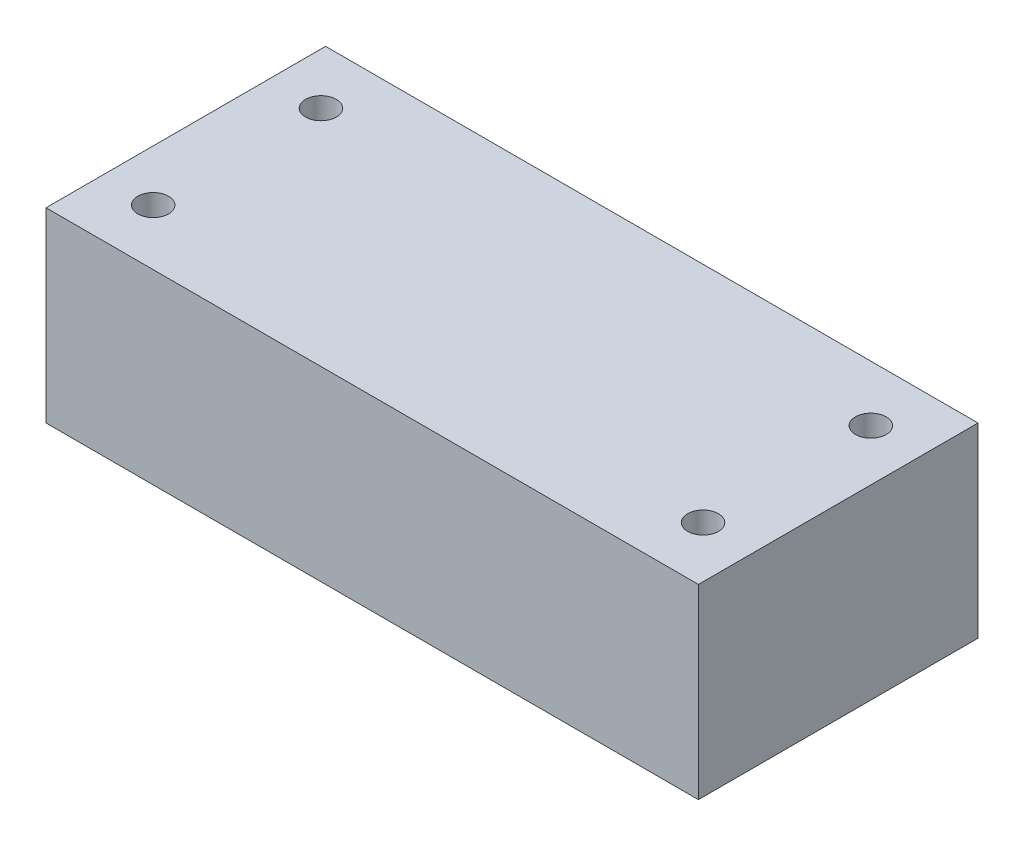
ISO-10303-21;
HEADER;
FILE_DESCRIPTION(('STEP AP214'),'2;1');
FILE_NAME('part.step','',(''),(''),'','','');
FILE_SCHEMA(('AUTOMOTIVE_DESIGN { 1 0 10303 214 1 1 1 1 }'));
ENDSEC;
DATA;
#1=APPLICATION_CONTEXT('core data for automotive mechanical design processes');
#2=APPLICATION_PROTOCOL_DEFINITION('international standard','automotive_design',2000,#1);
#3=PRODUCT_CONTEXT('',#1,'mechanical');
#4=PRODUCT('Part','Part','',(#3));
#5=PRODUCT_RELATED_PRODUCT_CATEGORY('part','',(#4));
#6=PRODUCT_DEFINITION_FORMATION('','',#4);
#7=PRODUCT_DEFINITION_CONTEXT('part definition',#1,'design');
#8=PRODUCT_DEFINITION('design','',#6,#7);
#9=PRODUCT_DEFINITION_SHAPE('','',#8);
#10=(LENGTH_UNIT() NAMED_UNIT(*) SI_UNIT(.MILLI.,.METRE.));
#11=(NAMED_UNIT(*) PLANE_ANGLE_UNIT() SI_UNIT($,.RADIAN.));
#12=(NAMED_UNIT(*) SI_UNIT($,.STERADIAN.) SOLID_ANGLE_UNIT());
#13=UNCERTAINTY_MEASURE_WITH_UNIT(LENGTH_MEASURE(1.E-05),#10,'distance_accuracy_value','');
#14=(GEOMETRIC_REPRESENTATION_CONTEXT(3) GLOBAL_UNCERTAINTY_ASSIGNED_CONTEXT((#13)) GLOBAL_UNIT_ASSIGNED_CONTEXT((#10,
#11,#12)) REPRESENTATION_CONTEXT('',''));
#15=CARTESIAN_POINT('',(0.,0.,0.));
#16=DIRECTION('',(0.,0.,1.));
#17=DIRECTION('',(1.,0.,0.));
#18=AXIS2_PLACEMENT_3D('',#15,#16,#17);
#19=CARTESIAN_POINT('',(35.,20.,15.));
#20=DIRECTION('',(-1.,0.,0.));
#21=DIRECTION('',(0.,0.,1.));
#22=AXIS2_PLACEMENT_3D('',#19,#20,#21);
#23=PLANE('',#22);
#24=DIRECTION('',(0.,0.,-1.));
#25=VECTOR('',#24,1.);
#26=CARTESIAN_POINT('',(35.,0.,15.));
#27=LINE('',#26,#25);
#28=CARTESIAN_POINT('',(35.,0.,15.));
#29=VERTEX_POINT('',#28);
#30=CARTESIAN_POINT('',(35.,0.,-15.));
#31=VERTEX_POINT('',#30);
#32=EDGE_CURVE('E98',#29,#31,#27,.T.);
#33=ORIENTED_EDGE('',*,*,#32,.T.);
#34=DIRECTION('',(0.,-1.,0.));
#35=VECTOR('',#34,1.);
#36=CARTESIAN_POINT('',(35.,20.,-15.));
#37=LINE('',#36,#35);
#38=CARTESIAN_POINT('',(35.,20.,-15.));
#39=VERTEX_POINT('',#38);
#40=EDGE_CURVE('E11',#39,#31,#37,.T.);
#41=ORIENTED_EDGE('',*,*,#40,.F.);
#42=DIRECTION('',(0.,0.,-1.));
#43=VECTOR('',#42,1.);
#44=CARTESIAN_POINT('',(35.,20.,15.));
#45=LINE('',#44,#43);
#46=CARTESIAN_POINT('',(35.,20.,15.));
#47=VERTEX_POINT('',#46);
#48=EDGE_CURVE('E85',#47,#39,#45,.T.);
#49=ORIENTED_EDGE('',*,*,#48,.F.);
#50=DIRECTION('',(0.,-1.,0.));
#51=VECTOR('',#50,1.);
#52=CARTESIAN_POINT('',(35.,20.,15.));
#53=LINE('',#52,#51);
#54=EDGE_CURVE('E94',#47,#29,#53,.T.);
#55=ORIENTED_EDGE('',*,*,#54,.T.);
#56=EDGE_LOOP('',(#33,#41,#49,#55));
#57=FACE_BOUND('',#56,.T.);
#58=ADVANCED_FACE('F32',(#57),#23,.F.);
#59=CARTESIAN_POINT('',(-35.,20.,-15.));
#60=DIRECTION('',(0.,0.,1.));
#61=DIRECTION('',(1.,0.,0.));
#62=AXIS2_PLACEMENT_3D('',#59,#60,#61);
#63=PLANE('',#62);
#64=DIRECTION('',(-1.,0.,0.));
#65=VECTOR('',#64,1.);
#66=CARTESIAN_POINT('',(-35.,0.,-15.));
#67=LINE('',#66,#65);
#68=CARTESIAN_POINT('',(-35.,0.,-15.));
#69=VERTEX_POINT('',#68);
#70=EDGE_CURVE('E89',#31,#69,#67,.T.);
#71=ORIENTED_EDGE('',*,*,#70,.T.);
#72=DIRECTION('',(0.,-1.,0.));
#73=VECTOR('',#72,1.);
#74=CARTESIAN_POINT('',(-35.,20.,-15.));
#75=LINE('',#74,#73);
#76=CARTESIAN_POINT('',(-35.,20.,-15.));
#77=VERTEX_POINT('',#76);
#78=EDGE_CURVE('E41',#77,#69,#75,.T.);
#79=ORIENTED_EDGE('',*,*,#78,.F.);
#80=DIRECTION('',(-1.,0.,0.));
#81=VECTOR('',#80,1.);
#82=CARTESIAN_POINT('',(-35.,20.,-15.));
#83=LINE('',#82,#81);
#84=EDGE_CURVE('E80',#39,#77,#83,.T.);
#85=ORIENTED_EDGE('',*,*,#84,.F.);
#86=ORIENTED_EDGE('',*,*,#40,.T.);
#87=EDGE_LOOP('',(#71,#79,#85,#86));
#88=FACE_BOUND('',#87,.T.);
#89=ADVANCED_FACE('F88',(#88),#63,.F.);
#90=CARTESIAN_POINT('',(-35.,20.,15.));
#91=DIRECTION('',(1.,0.,0.));
#92=DIRECTION('',(0.,0.,-1.));
#93=AXIS2_PLACEMENT_3D('',#90,#91,#92);
#94=PLANE('',#93);
#95=DIRECTION('',(0.,0.,1.));
#96=VECTOR('',#95,1.);
#97=CARTESIAN_POINT('',(-35.,0.,15.));
#98=LINE('',#97,#96);
#99=CARTESIAN_POINT('',(-35.,0.,15.));
#100=VERTEX_POINT('',#99);
#101=EDGE_CURVE('E67',#69,#100,#98,.T.);
#102=ORIENTED_EDGE('',*,*,#101,.T.);
#103=DIRECTION('',(0.,-1.,0.));
#104=VECTOR('',#103,1.);
#105=CARTESIAN_POINT('',(-35.,20.,15.));
#106=LINE('',#105,#104);
#107=CARTESIAN_POINT('',(-35.,20.,15.));
#108=VERTEX_POINT('',#107);
#109=EDGE_CURVE('E90',#108,#100,#106,.T.);
#110=ORIENTED_EDGE('',*,*,#109,.F.);
#111=DIRECTION('',(0.,0.,1.));
#112=VECTOR('',#111,1.);
#113=CARTESIAN_POINT('',(-35.,20.,15.));
#114=LINE('',#113,#112);
#115=EDGE_CURVE('E83',#77,#108,#114,.T.);
#116=ORIENTED_EDGE('',*,*,#115,.F.);
#117=ORIENTED_EDGE('',*,*,#78,.T.);
#118=EDGE_LOOP('',(#102,#110,#116,#117));
#119=FACE_BOUND('',#118,.T.);
#120=ADVANCED_FACE('F92',(#119),#94,.F.);
#121=CARTESIAN_POINT('',(-35.,20.,15.));
#122=DIRECTION('',(0.,0.,-1.));
#123=DIRECTION('',(-1.,0.,0.));
#124=AXIS2_PLACEMENT_3D('',#121,#122,#123);
#125=PLANE('',#124);
#126=DIRECTION('',(1.,0.,0.));
#127=VECTOR('',#126,1.);
#128=CARTESIAN_POINT('',(-35.,0.,15.));
#129=LINE('',#128,#127);
#130=EDGE_CURVE('E73',#100,#29,#129,.T.);
#131=ORIENTED_EDGE('',*,*,#130,.T.);
#132=ORIENTED_EDGE('',*,*,#54,.F.);
#133=DIRECTION('',(1.,0.,0.));
#134=VECTOR('',#133,1.);
#135=CARTESIAN_POINT('',(-35.,20.,15.));
#136=LINE('',#135,#134);
#137=EDGE_CURVE('E50',#108,#47,#136,.T.);
#138=ORIENTED_EDGE('',*,*,#137,.F.);
#139=ORIENTED_EDGE('',*,*,#109,.T.);
#140=EDGE_LOOP('',(#131,#132,#138,#139));
#141=FACE_BOUND('',#140,.T.);
#142=ADVANCED_FACE('F139',(#141),#125,.F.);
#143=CARTESIAN_POINT('',(0.,20.,0.));
#144=DIRECTION('',(0.,-1.,0.));
#145=DIRECTION('',(0.,0.,-1.));
#146=AXIS2_PLACEMENT_3D('',#143,#144,#145);
#147=PLANE('',#146);
#148=CARTESIAN_POINT('',(29.5,20.,-9.));
#149=DIRECTION('',(0.,1.,0.));
#150=DIRECTION('',(0.,0.,1.));
#151=AXIS2_PLACEMENT_3D('',#148,#149,#150);
#152=CIRCLE('',#151,1.65);
#153=CARTESIAN_POINT('',(29.5,20.,-7.35));
#154=VERTEX_POINT('',#153);
#155=EDGE_CURVE('E113',#154,#154,#152,.T.);
#156=ORIENTED_EDGE('',*,*,#155,.F.);
#157=EDGE_LOOP('',(#156));
#158=FACE_BOUND('',#157,.T.);
#159=CARTESIAN_POINT('',(29.5,20.,9.));
#160=DIRECTION('',(0.,1.,0.));
#161=DIRECTION('',(0.,0.,1.));
#162=AXIS2_PLACEMENT_3D('',#159,#160,#161);
#163=CIRCLE('',#162,1.65);
#164=CARTESIAN_POINT('',(29.5,20.,10.65));
#165=VERTEX_POINT('',#164);
#166=EDGE_CURVE('E128',#165,#165,#163,.T.);
#167=ORIENTED_EDGE('',*,*,#166,.F.);
#168=EDGE_LOOP('',(#167));
#169=FACE_BOUND('',#168,.T.);
#170=CARTESIAN_POINT('',(-29.5,20.,9.));
#171=DIRECTION('',(0.,1.,0.));
#172=DIRECTION('',(0.,0.,1.));
#173=AXIS2_PLACEMENT_3D('',#170,#171,#172);
#174=CIRCLE('',#173,1.65);
#175=CARTESIAN_POINT('',(-29.5,20.,10.65));
#176=VERTEX_POINT('',#175);
#177=EDGE_CURVE('E125',#176,#176,#174,.T.);
#178=ORIENTED_EDGE('',*,*,#177,.F.);
#179=EDGE_LOOP('',(#178));
#180=FACE_BOUND('',#179,.T.);
#181=CARTESIAN_POINT('',(-29.5,20.,-9.));
#182=DIRECTION('',(0.,1.,0.));
#183=DIRECTION('',(0.,0.,1.));
#184=AXIS2_PLACEMENT_3D('',#181,#182,#183);
#185=CIRCLE('',#184,1.65);
#186=CARTESIAN_POINT('',(-29.5,20.,-7.35));
#187=VERTEX_POINT('',#186);
#188=EDGE_CURVE('E109',#187,#187,#185,.T.);
#189=ORIENTED_EDGE('',*,*,#188,.F.);
#190=EDGE_LOOP('',(#189));
#191=FACE_BOUND('',#190,.T.);
#192=ORIENTED_EDGE('',*,*,#48,.T.);
#193=ORIENTED_EDGE('',*,*,#84,.T.);
#194=ORIENTED_EDGE('',*,*,#115,.T.);
#195=ORIENTED_EDGE('',*,*,#137,.T.);
#196=EDGE_LOOP('',(#192,#193,#194,#195));
#197=FACE_BOUND('',#196,.T.);
#198=ADVANCED_FACE('F81',(#158,#169,#180,#191,#197),#147,.F.);
#199=CARTESIAN_POINT('',(0.,0.,0.));
#200=DIRECTION('',(0.,-1.,0.));
#201=DIRECTION('',(0.,0.,-1.));
#202=AXIS2_PLACEMENT_3D('',#199,#200,#201);
#203=PLANE('',#202);
#204=CARTESIAN_POINT('',(29.5,0.,-9.));
#205=DIRECTION('',(0.,-1.,0.));
#206=DIRECTION('',(0.,0.,-1.));
#207=AXIS2_PLACEMENT_3D('',#204,#205,#206);
#208=CIRCLE('',#207,1.65);
#209=CARTESIAN_POINT('',(29.5,0.,-10.65));
#210=VERTEX_POINT('',#209);
#211=EDGE_CURVE('E35',#210,#210,#208,.T.);
#212=ORIENTED_EDGE('',*,*,#211,.F.);
#213=EDGE_LOOP('',(#212));
#214=FACE_BOUND('',#213,.T.);
#215=CARTESIAN_POINT('',(29.5,0.,9.));
#216=DIRECTION('',(0.,-1.,0.));
#217=DIRECTION('',(0.,0.,-1.));
#218=AXIS2_PLACEMENT_3D('',#215,#216,#217);
#219=CIRCLE('',#218,1.65);
#220=CARTESIAN_POINT('',(29.5,0.,7.35));
#221=VERTEX_POINT('',#220);
#222=EDGE_CURVE('E112',#221,#221,#219,.T.);
#223=ORIENTED_EDGE('',*,*,#222,.F.);
#224=EDGE_LOOP('',(#223));
#225=FACE_BOUND('',#224,.T.);
#226=CARTESIAN_POINT('',(-29.5,0.,9.));
#227=DIRECTION('',(0.,-1.,0.));
#228=DIRECTION('',(0.,0.,-1.));
#229=AXIS2_PLACEMENT_3D('',#226,#227,#228);
#230=CIRCLE('',#229,1.65);
#231=CARTESIAN_POINT('',(-29.5,0.,7.35));
#232=VERTEX_POINT('',#231);
#233=EDGE_CURVE('E110',#232,#232,#230,.T.);
#234=ORIENTED_EDGE('',*,*,#233,.F.);
#235=EDGE_LOOP('',(#234));
#236=FACE_BOUND('',#235,.T.);
#237=CARTESIAN_POINT('',(-29.5,0.,-9.));
#238=DIRECTION('',(0.,-1.,0.));
#239=DIRECTION('',(0.,0.,-1.));
#240=AXIS2_PLACEMENT_3D('',#237,#238,#239);
#241=CIRCLE('',#240,1.65);
#242=CARTESIAN_POINT('',(-29.5,0.,-10.65));
#243=VERTEX_POINT('',#242);
#244=EDGE_CURVE('E101',#243,#243,#241,.T.);
#245=ORIENTED_EDGE('',*,*,#244,.F.);
#246=EDGE_LOOP('',(#245));
#247=FACE_BOUND('',#246,.T.);
#248=ORIENTED_EDGE('',*,*,#32,.F.);
#249=ORIENTED_EDGE('',*,*,#130,.F.);
#250=ORIENTED_EDGE('',*,*,#101,.F.);
#251=ORIENTED_EDGE('',*,*,#70,.F.);
#252=EDGE_LOOP('',(#248,#249,#250,#251));
#253=FACE_BOUND('',#252,.T.);
#254=ADVANCED_FACE('F138',(#214,#225,#236,#247,#253),#203,.T.);
#255=CARTESIAN_POINT('',(-29.5,-10.,-9.));
#256=DIRECTION('',(0.,1.,0.));
#257=DIRECTION('',(0.,0.,1.));
#258=AXIS2_PLACEMENT_3D('',#255,#256,#257);
#259=CYLINDRICAL_SURFACE('',#258,1.65);
#260=ORIENTED_EDGE('',*,*,#244,.T.);
#261=EDGE_LOOP('',(#260));
#262=FACE_BOUND('',#261,.T.);
#263=ORIENTED_EDGE('',*,*,#188,.T.);
#264=EDGE_LOOP('',(#263));
#265=FACE_BOUND('',#264,.T.);
#266=ADVANCED_FACE('F149',(#262,#265),#259,.F.);
#267=CARTESIAN_POINT('',(-29.5,-10.,9.));
#268=DIRECTION('',(0.,1.,0.));
#269=DIRECTION('',(0.,0.,1.));
#270=AXIS2_PLACEMENT_3D('',#267,#268,#269);
#271=CYLINDRICAL_SURFACE('',#270,1.65);
#272=ORIENTED_EDGE('',*,*,#233,.T.);
#273=EDGE_LOOP('',(#272));
#274=FACE_BOUND('',#273,.T.);
#275=ORIENTED_EDGE('',*,*,#177,.T.);
#276=EDGE_LOOP('',(#275));
#277=FACE_BOUND('',#276,.T.);
#278=ADVANCED_FACE('F146',(#274,#277),#271,.F.);
#279=CARTESIAN_POINT('',(29.5,-10.,9.));
#280=DIRECTION('',(0.,1.,0.));
#281=DIRECTION('',(0.,0.,1.));
#282=AXIS2_PLACEMENT_3D('',#279,#280,#281);
#283=CYLINDRICAL_SURFACE('',#282,1.65);
#284=ORIENTED_EDGE('',*,*,#222,.T.);
#285=EDGE_LOOP('',(#284));
#286=FACE_BOUND('',#285,.T.);
#287=ORIENTED_EDGE('',*,*,#166,.T.);
#288=EDGE_LOOP('',(#287));
#289=FACE_BOUND('',#288,.T.);
#290=ADVANCED_FACE('F148',(#286,#289),#283,.F.);
#291=CARTESIAN_POINT('',(29.5,-10.,-9.));
#292=DIRECTION('',(0.,1.,0.));
#293=DIRECTION('',(0.,0.,1.));
#294=AXIS2_PLACEMENT_3D('',#291,#292,#293);
#295=CYLINDRICAL_SURFACE('',#294,1.65);
#296=ORIENTED_EDGE('',*,*,#211,.T.);
#297=EDGE_LOOP('',(#296));
#298=FACE_BOUND('',#297,.T.);
#299=ORIENTED_EDGE('',*,*,#155,.T.);
#300=EDGE_LOOP('',(#299));
#301=FACE_BOUND('',#300,.T.);
#302=ADVANCED_FACE('F134',(#298,#301),#295,.F.);
#303=CLOSED_SHELL('',(#58,#89,#120,#142,#198,#254,#266,#278,#290,#302));
#304=MANIFOLD_SOLID_BREP('B2',#303);
#305=ADVANCED_BREP_SHAPE_REPRESENTATION('',(#18,#304),#14);
#306=SHAPE_DEFINITION_REPRESENTATION(#9,#305);
ENDSEC;
END-ISO-10303-21;
